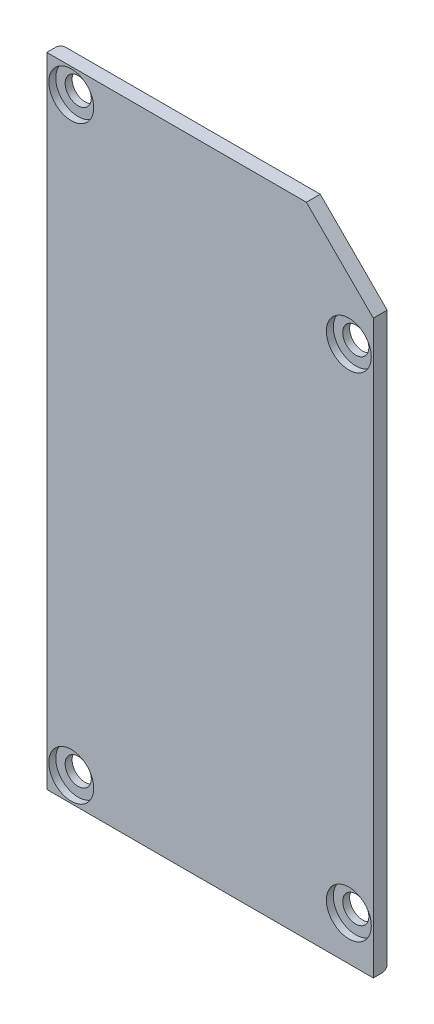
ISO-10303-21;
HEADER;
FILE_DESCRIPTION(('STEP AP214'),'2;1');
FILE_NAME('part.step','',(''),(''),'','','');
FILE_SCHEMA(('AUTOMOTIVE_DESIGN { 1 0 10303 214 1 1 1 1 }'));
ENDSEC;
DATA;
#1=APPLICATION_CONTEXT('core data for automotive mechanical design processes');
#2=APPLICATION_PROTOCOL_DEFINITION('international standard','automotive_design',2000,#1);
#3=PRODUCT_CONTEXT('',#1,'mechanical');
#4=PRODUCT('Part','Part','',(#3));
#5=PRODUCT_RELATED_PRODUCT_CATEGORY('part','',(#4));
#6=PRODUCT_DEFINITION_FORMATION('','',#4);
#7=PRODUCT_DEFINITION_CONTEXT('part definition',#1,'design');
#8=PRODUCT_DEFINITION('design','',#6,#7);
#9=PRODUCT_DEFINITION_SHAPE('','',#8);
#10=(LENGTH_UNIT() NAMED_UNIT(*) SI_UNIT(.MILLI.,.METRE.));
#11=(NAMED_UNIT(*) PLANE_ANGLE_UNIT() SI_UNIT($,.RADIAN.));
#12=(NAMED_UNIT(*) SI_UNIT($,.STERADIAN.) SOLID_ANGLE_UNIT());
#13=UNCERTAINTY_MEASURE_WITH_UNIT(LENGTH_MEASURE(1.E-05),#10,'distance_accuracy_value','');
#14=(GEOMETRIC_REPRESENTATION_CONTEXT(3) GLOBAL_UNCERTAINTY_ASSIGNED_CONTEXT((#13)) GLOBAL_UNIT_ASSIGNED_CONTEXT((#10,
#11,#12)) REPRESENTATION_CONTEXT('',''));
#15=CARTESIAN_POINT('',(0.,0.,0.));
#16=DIRECTION('',(0.,0.,1.));
#17=DIRECTION('',(1.,0.,0.));
#18=AXIS2_PLACEMENT_3D('',#15,#16,#17);
#19=CARTESIAN_POINT('',(37.,5.39999999999994,29.7));
#20=DIRECTION('',(0.,0.,-1.));
#21=DIRECTION('',(-1.,0.,0.));
#22=AXIS2_PLACEMENT_3D('',#19,#20,#21);
#23=CYLINDRICAL_SURFACE('',#22,1.6);
#24=CARTESIAN_POINT('',(37.,5.39999999999994,28.));
#25=DIRECTION('',(0.,0.,-1.));
#26=DIRECTION('',(-1.,0.,0.));
#27=AXIS2_PLACEMENT_3D('',#24,#25,#26);
#28=CIRCLE('',#27,1.6);
#29=CARTESIAN_POINT('',(35.4,5.39999999999994,28.));
#30=VERTEX_POINT('',#29);
#31=EDGE_CURVE('E237',#30,#30,#28,.T.);
#32=ORIENTED_EDGE('',*,*,#31,.T.);
#33=EDGE_LOOP('',(#32));
#34=FACE_BOUND('',#33,.T.);
#35=CARTESIAN_POINT('',(37.,5.39999999999994,28.85));
#36=DIRECTION('',(0.,0.,1.));
#37=DIRECTION('',(1.,0.,0.));
#38=AXIS2_PLACEMENT_3D('',#35,#36,#37);
#39=CIRCLE('',#38,1.6);
#40=CARTESIAN_POINT('',(38.6,5.39999999999994,28.85));
#41=VERTEX_POINT('',#40);
#42=EDGE_CURVE('E142',#41,#41,#39,.T.);
#43=ORIENTED_EDGE('',*,*,#42,.T.);
#44=EDGE_LOOP('',(#43));
#45=FACE_BOUND('',#44,.T.);
#46=ADVANCED_FACE('F37',(#34,#45),#23,.F.);
#47=CARTESIAN_POINT('',(3.,3.,29.7));
#48=DIRECTION('',(0.,0.,-1.));
#49=DIRECTION('',(-1.,0.,0.));
#50=AXIS2_PLACEMENT_3D('',#47,#48,#49);
#51=CYLINDRICAL_SURFACE('',#50,1.6);
#52=CARTESIAN_POINT('',(3.,3.,28.));
#53=DIRECTION('',(0.,0.,-1.));
#54=DIRECTION('',(-1.,0.,0.));
#55=AXIS2_PLACEMENT_3D('',#52,#53,#54);
#56=CIRCLE('',#55,1.6);
#57=CARTESIAN_POINT('',(1.4,3.,28.));
#58=VERTEX_POINT('',#57);
#59=EDGE_CURVE('E130',#58,#58,#56,.T.);
#60=ORIENTED_EDGE('',*,*,#59,.T.);
#61=EDGE_LOOP('',(#60));
#62=FACE_BOUND('',#61,.T.);
#63=CARTESIAN_POINT('',(3.,3.,28.85));
#64=DIRECTION('',(0.,0.,1.));
#65=DIRECTION('',(1.,0.,0.));
#66=AXIS2_PLACEMENT_3D('',#63,#64,#65);
#67=CIRCLE('',#66,1.6);
#68=CARTESIAN_POINT('',(4.6,3.,28.85));
#69=VERTEX_POINT('',#68);
#70=EDGE_CURVE('E137',#69,#69,#67,.T.);
#71=ORIENTED_EDGE('',*,*,#70,.T.);
#72=EDGE_LOOP('',(#71));
#73=FACE_BOUND('',#72,.T.);
#74=ADVANCED_FACE('F177',(#62,#73),#51,.F.);
#75=CARTESIAN_POINT('',(37.,65.7573593128807,29.7));
#76=DIRECTION('',(0.,0.,-1.));
#77=DIRECTION('',(-1.,0.,0.));
#78=AXIS2_PLACEMENT_3D('',#75,#76,#77);
#79=CYLINDRICAL_SURFACE('',#78,1.6);
#80=CARTESIAN_POINT('',(37.,65.7573593128807,28.));
#81=DIRECTION('',(0.,0.,-1.));
#82=DIRECTION('',(-1.,0.,0.));
#83=AXIS2_PLACEMENT_3D('',#80,#81,#82);
#84=CIRCLE('',#83,1.6);
#85=CARTESIAN_POINT('',(35.4,65.7573593128807,28.));
#86=VERTEX_POINT('',#85);
#87=EDGE_CURVE('E234',#86,#86,#84,.T.);
#88=ORIENTED_EDGE('',*,*,#87,.T.);
#89=EDGE_LOOP('',(#88));
#90=FACE_BOUND('',#89,.T.);
#91=CARTESIAN_POINT('',(37.,65.7573593128807,28.85));
#92=DIRECTION('',(0.,0.,1.));
#93=DIRECTION('',(1.,0.,0.));
#94=AXIS2_PLACEMENT_3D('',#91,#92,#93);
#95=CIRCLE('',#94,1.6);
#96=CARTESIAN_POINT('',(38.6,65.7573593128807,28.85));
#97=VERTEX_POINT('',#96);
#98=EDGE_CURVE('E132',#97,#97,#95,.T.);
#99=ORIENTED_EDGE('',*,*,#98,.T.);
#100=EDGE_LOOP('',(#99));
#101=FACE_BOUND('',#100,.T.);
#102=ADVANCED_FACE('F183',(#90,#101),#79,.F.);
#103=CARTESIAN_POINT('',(3.,75.2,29.7));
#104=DIRECTION('',(0.,0.,-1.));
#105=DIRECTION('',(-1.,0.,0.));
#106=AXIS2_PLACEMENT_3D('',#103,#104,#105);
#107=CYLINDRICAL_SURFACE('',#106,1.6);
#108=CARTESIAN_POINT('',(3.,75.2,28.));
#109=DIRECTION('',(0.,0.,-1.));
#110=DIRECTION('',(-1.,0.,0.));
#111=AXIS2_PLACEMENT_3D('',#108,#109,#110);
#112=CIRCLE('',#111,1.6);
#113=CARTESIAN_POINT('',(1.4,75.2,28.));
#114=VERTEX_POINT('',#113);
#115=EDGE_CURVE('E101',#114,#114,#112,.T.);
#116=ORIENTED_EDGE('',*,*,#115,.T.);
#117=EDGE_LOOP('',(#116));
#118=FACE_BOUND('',#117,.T.);
#119=CARTESIAN_POINT('',(3.,75.2,28.85));
#120=DIRECTION('',(0.,0.,1.));
#121=DIRECTION('',(1.,0.,0.));
#122=AXIS2_PLACEMENT_3D('',#119,#120,#121);
#123=CIRCLE('',#122,1.6);
#124=CARTESIAN_POINT('',(4.6,75.2,28.85));
#125=VERTEX_POINT('',#124);
#126=EDGE_CURVE('E127',#125,#125,#123,.T.);
#127=ORIENTED_EDGE('',*,*,#126,.T.);
#128=EDGE_LOOP('',(#127));
#129=FACE_BOUND('',#128,.T.);
#130=ADVANCED_FACE('F192',(#118,#129),#107,.F.);
#131=CARTESIAN_POINT('',(0.,0.,28.));
#132=DIRECTION('',(0.,1.,0.));
#133=DIRECTION('',(0.,0.,1.));
#134=AXIS2_PLACEMENT_3D('',#131,#132,#133);
#135=PLANE('',#134);
#136=DIRECTION('',(0.,0.,-1.));
#137=VECTOR('',#136,1.);
#138=CARTESIAN_POINT('',(0.,0.,28.));
#139=LINE('',#138,#137);
#140=CARTESIAN_POINT('',(0.,0.,29.7));
#141=VERTEX_POINT('',#140);
#142=CARTESIAN_POINT('',(0.,0.,28.6));
#143=VERTEX_POINT('',#142);
#144=EDGE_CURVE('E125',#141,#143,#139,.T.);
#145=ORIENTED_EDGE('',*,*,#144,.T.);
#146=DIRECTION('',(-1.,0.,0.));
#147=VECTOR('',#146,1.);
#148=CARTESIAN_POINT('',(40.,0.,28.6));
#149=LINE('',#148,#147);
#150=CARTESIAN_POINT('',(40.,0.,28.6));
#151=VERTEX_POINT('',#150);
#152=EDGE_CURVE('E150',#143,#151,#149,.F.);
#153=ORIENTED_EDGE('',*,*,#152,.T.);
#154=DIRECTION('',(0.,0.,-1.));
#155=VECTOR('',#154,1.);
#156=CARTESIAN_POINT('',(40.,0.,28.));
#157=LINE('',#156,#155);
#158=CARTESIAN_POINT('',(40.,0.,29.7));
#159=VERTEX_POINT('',#158);
#160=EDGE_CURVE('E118',#159,#151,#157,.T.);
#161=ORIENTED_EDGE('',*,*,#160,.F.);
#162=DIRECTION('',(1.,0.,0.));
#163=VECTOR('',#162,1.);
#164=CARTESIAN_POINT('',(40.,0.,29.7));
#165=LINE('',#164,#163);
#166=EDGE_CURVE('E220',#141,#159,#165,.T.);
#167=ORIENTED_EDGE('',*,*,#166,.F.);
#168=EDGE_LOOP('',(#145,#153,#161,#167));
#169=FACE_BOUND('',#168,.T.);
#170=ADVANCED_FACE('F196',(#169),#135,.F.);
#171=CARTESIAN_POINT('',(40.,0.,28.));
#172=DIRECTION('',(-1.,0.,0.));
#173=DIRECTION('',(0.,0.,1.));
#174=AXIS2_PLACEMENT_3D('',#171,#172,#173);
#175=PLANE('',#174);
#176=ORIENTED_EDGE('',*,*,#160,.T.);
#177=CARTESIAN_POINT('',(40.,0.6,28.6));
#178=DIRECTION('',(-1.,0.,0.));
#179=DIRECTION('',(0.,0.,1.));
#180=AXIS2_PLACEMENT_3D('',#177,#178,#179);
#181=CIRCLE('',#180,0.6);
#182=CARTESIAN_POINT('',(40.,0.6,28.));
#183=VERTEX_POINT('',#182);
#184=EDGE_CURVE('E152',#151,#183,#181,.F.);
#185=ORIENTED_EDGE('',*,*,#184,.T.);
#186=DIRECTION('',(0.,-1.,0.));
#187=VECTOR('',#186,1.);
#188=CARTESIAN_POINT('',(40.,0.,28.));
#189=LINE('',#188,#187);
#190=CARTESIAN_POINT('',(40.,70.,28.));
#191=VERTEX_POINT('',#190);
#192=EDGE_CURVE('E110',#191,#183,#189,.T.);
#193=ORIENTED_EDGE('',*,*,#192,.F.);
#194=DIRECTION('',(0.,0.,-1.));
#195=VECTOR('',#194,1.);
#196=CARTESIAN_POINT('',(40.,70.,28.));
#197=LINE('',#196,#195);
#198=CARTESIAN_POINT('',(40.,70.,29.7));
#199=VERTEX_POINT('',#198);
#200=EDGE_CURVE('E109',#199,#191,#197,.T.);
#201=ORIENTED_EDGE('',*,*,#200,.F.);
#202=DIRECTION('',(0.,1.,0.));
#203=VECTOR('',#202,1.);
#204=CARTESIAN_POINT('',(40.,70.,29.7));
#205=LINE('',#204,#203);
#206=EDGE_CURVE('E225',#159,#199,#205,.T.);
#207=ORIENTED_EDGE('',*,*,#206,.F.);
#208=EDGE_LOOP('',(#176,#185,#193,#201,#207));
#209=FACE_BOUND('',#208,.T.);
#210=ADVANCED_FACE('F156',(#209),#175,.F.);
#211=CARTESIAN_POINT('',(31.8000000000001,78.2,28.));
#212=DIRECTION('',(-0.707106781186551,-0.707106781186544,0.));
#213=DIRECTION('',(0.707106781186544,-0.707106781186551,0.));
#214=AXIS2_PLACEMENT_3D('',#211,#212,#213);
#215=PLANE('',#214);
#216=DIRECTION('',(0.707106781186544,-0.707106781186551,0.));
#217=VECTOR('',#216,1.);
#218=CARTESIAN_POINT('',(31.8000000000001,78.2,28.));
#219=LINE('',#218,#217);
#220=CARTESIAN_POINT('',(31.8000000000001,78.2,28.));
#221=VERTEX_POINT('',#220);
#222=EDGE_CURVE('E95',#221,#191,#219,.T.);
#223=ORIENTED_EDGE('',*,*,#222,.F.);
#224=DIRECTION('',(0.,0.,-1.));
#225=VECTOR('',#224,1.);
#226=CARTESIAN_POINT('',(31.8000000000001,78.2,28.));
#227=LINE('',#226,#225);
#228=CARTESIAN_POINT('',(31.8000000000001,78.2,29.7));
#229=VERTEX_POINT('',#228);
#230=EDGE_CURVE('E107',#229,#221,#227,.T.);
#231=ORIENTED_EDGE('',*,*,#230,.F.);
#232=DIRECTION('',(-0.707106781186544,0.707106781186551,0.));
#233=VECTOR('',#232,1.);
#234=CARTESIAN_POINT('',(31.8000000000001,78.2,29.7));
#235=LINE('',#234,#233);
#236=EDGE_CURVE('E230',#199,#229,#235,.T.);
#237=ORIENTED_EDGE('',*,*,#236,.F.);
#238=ORIENTED_EDGE('',*,*,#200,.T.);
#239=EDGE_LOOP('',(#223,#231,#237,#238));
#240=FACE_BOUND('',#239,.T.);
#241=ADVANCED_FACE('F105',(#240),#215,.F.);
#242=CARTESIAN_POINT('',(0.,78.2,28.));
#243=DIRECTION('',(0.,-1.,0.));
#244=DIRECTION('',(0.,0.,-1.));
#245=AXIS2_PLACEMENT_3D('',#242,#243,#244);
#246=PLANE('',#245);
#247=DIRECTION('',(1.,0.,0.));
#248=VECTOR('',#247,1.);
#249=CARTESIAN_POINT('',(0.,78.2,28.));
#250=LINE('',#249,#248);
#251=CARTESIAN_POINT('',(0.6,78.2,28.));
#252=VERTEX_POINT('',#251);
#253=EDGE_CURVE('E90',#252,#221,#250,.T.);
#254=ORIENTED_EDGE('',*,*,#253,.F.);
#255=CARTESIAN_POINT('',(0.6,78.2,28.6));
#256=DIRECTION('',(0.,-1.,0.));
#257=DIRECTION('',(0.,0.,-1.));
#258=AXIS2_PLACEMENT_3D('',#255,#256,#257);
#259=CIRCLE('',#258,0.6);
#260=CARTESIAN_POINT('',(0.,78.2,28.6));
#261=VERTEX_POINT('',#260);
#262=EDGE_CURVE('E11',#252,#261,#259,.F.);
#263=ORIENTED_EDGE('',*,*,#262,.T.);
#264=DIRECTION('',(0.,0.,-1.));
#265=VECTOR('',#264,1.);
#266=CARTESIAN_POINT('',(0.,78.2,28.));
#267=LINE('',#266,#265);
#268=CARTESIAN_POINT('',(0.,78.2,29.7));
#269=VERTEX_POINT('',#268);
#270=EDGE_CURVE('E116',#269,#261,#267,.T.);
#271=ORIENTED_EDGE('',*,*,#270,.F.);
#272=DIRECTION('',(-1.,0.,0.));
#273=VECTOR('',#272,1.);
#274=CARTESIAN_POINT('',(0.,78.2,29.7));
#275=LINE('',#274,#273);
#276=EDGE_CURVE('E115',#229,#269,#275,.T.);
#277=ORIENTED_EDGE('',*,*,#276,.F.);
#278=ORIENTED_EDGE('',*,*,#230,.T.);
#279=EDGE_LOOP('',(#254,#263,#271,#277,#278));
#280=FACE_BOUND('',#279,.T.);
#281=ADVANCED_FACE('F113',(#280),#246,.F.);
#282=CARTESIAN_POINT('',(0.,78.2,28.));
#283=DIRECTION('',(1.,0.,0.));
#284=DIRECTION('',(0.,0.,-1.));
#285=AXIS2_PLACEMENT_3D('',#282,#283,#284);
#286=PLANE('',#285);
#287=ORIENTED_EDGE('',*,*,#270,.T.);
#288=DIRECTION('',(0.,-1.,0.));
#289=VECTOR('',#288,1.);
#290=CARTESIAN_POINT('',(0.,0.,28.6));
#291=LINE('',#290,#289);
#292=EDGE_CURVE('E46',#261,#143,#291,.T.);
#293=ORIENTED_EDGE('',*,*,#292,.T.);
#294=ORIENTED_EDGE('',*,*,#144,.F.);
#295=DIRECTION('',(0.,-1.,0.));
#296=VECTOR('',#295,1.);
#297=CARTESIAN_POINT('',(0.,0.,29.7));
#298=LINE('',#297,#296);
#299=EDGE_CURVE('E161',#269,#141,#298,.T.);
#300=ORIENTED_EDGE('',*,*,#299,.F.);
#301=EDGE_LOOP('',(#287,#293,#294,#300));
#302=FACE_BOUND('',#301,.T.);
#303=ADVANCED_FACE('F201',(#302),#286,.F.);
#304=CARTESIAN_POINT('',(0.,0.,29.7));
#305=DIRECTION('',(0.,0.,-1.));
#306=DIRECTION('',(-1.,0.,0.));
#307=AXIS2_PLACEMENT_3D('',#304,#305,#306);
#308=PLANE('',#307);
#309=CARTESIAN_POINT('',(37.,5.39999999999994,29.7));
#310=DIRECTION('',(0.,0.,1.));
#311=DIRECTION('',(1.,0.,0.));
#312=AXIS2_PLACEMENT_3D('',#309,#310,#311);
#313=CIRCLE('',#312,2.75);
#314=CARTESIAN_POINT('',(39.75,5.39999999999994,29.7));
#315=VERTEX_POINT('',#314);
#316=EDGE_CURVE('E166',#315,#315,#313,.T.);
#317=ORIENTED_EDGE('',*,*,#316,.F.);
#318=EDGE_LOOP('',(#317));
#319=FACE_BOUND('',#318,.T.);
#320=CARTESIAN_POINT('',(3.,3.,29.7));
#321=DIRECTION('',(0.,0.,1.));
#322=DIRECTION('',(1.,0.,0.));
#323=AXIS2_PLACEMENT_3D('',#320,#321,#322);
#324=CIRCLE('',#323,2.75);
#325=CARTESIAN_POINT('',(5.75,3.,29.7));
#326=VERTEX_POINT('',#325);
#327=EDGE_CURVE('E145',#326,#326,#324,.T.);
#328=ORIENTED_EDGE('',*,*,#327,.F.);
#329=EDGE_LOOP('',(#328));
#330=FACE_BOUND('',#329,.T.);
#331=CARTESIAN_POINT('',(37.,65.7573593128807,29.7));
#332=DIRECTION('',(0.,0.,1.));
#333=DIRECTION('',(1.,0.,0.));
#334=AXIS2_PLACEMENT_3D('',#331,#332,#333);
#335=CIRCLE('',#334,2.75);
#336=CARTESIAN_POINT('',(39.75,65.7573593128807,29.7));
#337=VERTEX_POINT('',#336);
#338=EDGE_CURVE('E140',#337,#337,#335,.T.);
#339=ORIENTED_EDGE('',*,*,#338,.F.);
#340=EDGE_LOOP('',(#339));
#341=FACE_BOUND('',#340,.T.);
#342=CARTESIAN_POINT('',(3.,75.2,29.7));
#343=DIRECTION('',(0.,0.,1.));
#344=DIRECTION('',(1.,0.,0.));
#345=AXIS2_PLACEMENT_3D('',#342,#343,#344);
#346=CIRCLE('',#345,2.75);
#347=CARTESIAN_POINT('',(5.75,75.2,29.7));
#348=VERTEX_POINT('',#347);
#349=EDGE_CURVE('E135',#348,#348,#346,.T.);
#350=ORIENTED_EDGE('',*,*,#349,.F.);
#351=EDGE_LOOP('',(#350));
#352=FACE_BOUND('',#351,.T.);
#353=ORIENTED_EDGE('',*,*,#299,.T.);
#354=ORIENTED_EDGE('',*,*,#166,.T.);
#355=ORIENTED_EDGE('',*,*,#206,.T.);
#356=ORIENTED_EDGE('',*,*,#236,.T.);
#357=ORIENTED_EDGE('',*,*,#276,.T.);
#358=EDGE_LOOP('',(#353,#354,#355,#356,#357));
#359=FACE_BOUND('',#358,.T.);
#360=ADVANCED_FACE('F198',(#319,#330,#341,#352,#359),#308,.F.);
#361=CARTESIAN_POINT('',(0.,0.,28.));
#362=DIRECTION('',(0.,0.,-1.));
#363=DIRECTION('',(-1.,0.,0.));
#364=AXIS2_PLACEMENT_3D('',#361,#362,#363);
#365=PLANE('',#364);
#366=ORIENTED_EDGE('',*,*,#192,.T.);
#367=DIRECTION('',(-1.,0.,0.));
#368=VECTOR('',#367,1.);
#369=CARTESIAN_POINT('',(0.,0.6,28.));
#370=LINE('',#369,#368);
#371=CARTESIAN_POINT('',(0.6,0.6,28.));
#372=VERTEX_POINT('',#371);
#373=EDGE_CURVE('E148',#183,#372,#370,.T.);
#374=ORIENTED_EDGE('',*,*,#373,.T.);
#375=DIRECTION('',(0.,-1.,0.));
#376=VECTOR('',#375,1.);
#377=CARTESIAN_POINT('',(0.6,78.2,28.));
#378=LINE('',#377,#376);
#379=EDGE_CURVE('E99',#372,#252,#378,.F.);
#380=ORIENTED_EDGE('',*,*,#379,.T.);
#381=ORIENTED_EDGE('',*,*,#253,.T.);
#382=ORIENTED_EDGE('',*,*,#222,.T.);
#383=EDGE_LOOP('',(#366,#374,#380,#381,#382));
#384=FACE_BOUND('',#383,.T.);
#385=ORIENTED_EDGE('',*,*,#59,.F.);
#386=EDGE_LOOP('',(#385));
#387=FACE_BOUND('',#386,.T.);
#388=ORIENTED_EDGE('',*,*,#31,.F.);
#389=EDGE_LOOP('',(#388));
#390=FACE_BOUND('',#389,.T.);
#391=ORIENTED_EDGE('',*,*,#87,.F.);
#392=EDGE_LOOP('',(#391));
#393=FACE_BOUND('',#392,.T.);
#394=ORIENTED_EDGE('',*,*,#115,.F.);
#395=EDGE_LOOP('',(#394));
#396=FACE_BOUND('',#395,.T.);
#397=ADVANCED_FACE('F93',(#384,#387,#390,#393,#396),#365,.T.);
#398=CARTESIAN_POINT('',(3.,75.2,28.85));
#399=DIRECTION('',(0.,0.,1.));
#400=DIRECTION('',(1.,0.,0.));
#401=AXIS2_PLACEMENT_3D('',#398,#399,#400);
#402=CYLINDRICAL_SURFACE('',#401,2.75);
#403=CARTESIAN_POINT('',(3.,75.2,28.85));
#404=DIRECTION('',(0.,0.,1.));
#405=DIRECTION('',(1.,0.,0.));
#406=AXIS2_PLACEMENT_3D('',#403,#404,#405);
#407=CIRCLE('',#406,2.75);
#408=CARTESIAN_POINT('',(5.75,75.2,28.85));
#409=VERTEX_POINT('',#408);
#410=EDGE_CURVE('E131',#409,#409,#407,.T.);
#411=ORIENTED_EDGE('',*,*,#410,.F.);
#412=EDGE_LOOP('',(#411));
#413=FACE_BOUND('',#412,.T.);
#414=ORIENTED_EDGE('',*,*,#349,.T.);
#415=EDGE_LOOP('',(#414));
#416=FACE_BOUND('',#415,.T.);
#417=ADVANCED_FACE('F205',(#413,#416),#402,.F.);
#418=CARTESIAN_POINT('',(3.,75.2,28.85));
#419=DIRECTION('',(0.,0.,1.));
#420=DIRECTION('',(1.,0.,0.));
#421=AXIS2_PLACEMENT_3D('',#418,#419,#420);
#422=PLANE('',#421);
#423=ORIENTED_EDGE('',*,*,#126,.F.);
#424=EDGE_LOOP('',(#423));
#425=FACE_BOUND('',#424,.T.);
#426=ORIENTED_EDGE('',*,*,#410,.T.);
#427=EDGE_LOOP('',(#426));
#428=FACE_BOUND('',#427,.T.);
#429=ADVANCED_FACE('F272',(#425,#428),#422,.T.);
#430=CARTESIAN_POINT('',(37.,65.7573593128807,28.85));
#431=DIRECTION('',(0.,0.,1.));
#432=DIRECTION('',(1.,0.,0.));
#433=AXIS2_PLACEMENT_3D('',#430,#431,#432);
#434=CYLINDRICAL_SURFACE('',#433,2.75);
#435=CARTESIAN_POINT('',(37.,65.7573593128807,28.85));
#436=DIRECTION('',(0.,0.,1.));
#437=DIRECTION('',(1.,0.,0.));
#438=AXIS2_PLACEMENT_3D('',#435,#436,#437);
#439=CIRCLE('',#438,2.75);
#440=CARTESIAN_POINT('',(39.75,65.7573593128807,28.85));
#441=VERTEX_POINT('',#440);
#442=EDGE_CURVE('E136',#441,#441,#439,.T.);
#443=ORIENTED_EDGE('',*,*,#442,.F.);
#444=EDGE_LOOP('',(#443));
#445=FACE_BOUND('',#444,.T.);
#446=ORIENTED_EDGE('',*,*,#338,.T.);
#447=EDGE_LOOP('',(#446));
#448=FACE_BOUND('',#447,.T.);
#449=ADVANCED_FACE('F277',(#445,#448),#434,.F.);
#450=CARTESIAN_POINT('',(37.,65.7573593128807,28.85));
#451=DIRECTION('',(0.,0.,1.));
#452=DIRECTION('',(1.,0.,0.));
#453=AXIS2_PLACEMENT_3D('',#450,#451,#452);
#454=PLANE('',#453);
#455=ORIENTED_EDGE('',*,*,#98,.F.);
#456=EDGE_LOOP('',(#455));
#457=FACE_BOUND('',#456,.T.);
#458=ORIENTED_EDGE('',*,*,#442,.T.);
#459=EDGE_LOOP('',(#458));
#460=FACE_BOUND('',#459,.T.);
#461=ADVANCED_FACE('F284',(#457,#460),#454,.T.);
#462=CARTESIAN_POINT('',(3.,3.,28.85));
#463=DIRECTION('',(0.,0.,1.));
#464=DIRECTION('',(1.,0.,0.));
#465=AXIS2_PLACEMENT_3D('',#462,#463,#464);
#466=CYLINDRICAL_SURFACE('',#465,2.75);
#467=CARTESIAN_POINT('',(3.,3.,28.85));
#468=DIRECTION('',(0.,0.,1.));
#469=DIRECTION('',(1.,0.,0.));
#470=AXIS2_PLACEMENT_3D('',#467,#468,#469);
#471=CIRCLE('',#470,2.75);
#472=CARTESIAN_POINT('',(5.75,3.,28.85));
#473=VERTEX_POINT('',#472);
#474=EDGE_CURVE('E141',#473,#473,#471,.T.);
#475=ORIENTED_EDGE('',*,*,#474,.F.);
#476=EDGE_LOOP('',(#475));
#477=FACE_BOUND('',#476,.T.);
#478=ORIENTED_EDGE('',*,*,#327,.T.);
#479=EDGE_LOOP('',(#478));
#480=FACE_BOUND('',#479,.T.);
#481=ADVANCED_FACE('F288',(#477,#480),#466,.F.);
#482=CARTESIAN_POINT('',(3.,3.,28.85));
#483=DIRECTION('',(0.,0.,1.));
#484=DIRECTION('',(1.,0.,0.));
#485=AXIS2_PLACEMENT_3D('',#482,#483,#484);
#486=PLANE('',#485);
#487=ORIENTED_EDGE('',*,*,#70,.F.);
#488=EDGE_LOOP('',(#487));
#489=FACE_BOUND('',#488,.T.);
#490=ORIENTED_EDGE('',*,*,#474,.T.);
#491=EDGE_LOOP('',(#490));
#492=FACE_BOUND('',#491,.T.);
#493=ADVANCED_FACE('F261',(#489,#492),#486,.T.);
#494=CARTESIAN_POINT('',(37.,5.39999999999994,28.85));
#495=DIRECTION('',(0.,0.,1.));
#496=DIRECTION('',(1.,0.,0.));
#497=AXIS2_PLACEMENT_3D('',#494,#495,#496);
#498=CYLINDRICAL_SURFACE('',#497,2.75);
#499=CARTESIAN_POINT('',(37.,5.39999999999994,28.85));
#500=DIRECTION('',(0.,0.,1.));
#501=DIRECTION('',(1.,0.,0.));
#502=AXIS2_PLACEMENT_3D('',#499,#500,#501);
#503=CIRCLE('',#502,2.75);
#504=CARTESIAN_POINT('',(39.75,5.39999999999994,28.85));
#505=VERTEX_POINT('',#504);
#506=EDGE_CURVE('E146',#505,#505,#503,.T.);
#507=ORIENTED_EDGE('',*,*,#506,.F.);
#508=EDGE_LOOP('',(#507));
#509=FACE_BOUND('',#508,.T.);
#510=ORIENTED_EDGE('',*,*,#316,.T.);
#511=EDGE_LOOP('',(#510));
#512=FACE_BOUND('',#511,.T.);
#513=ADVANCED_FACE('F173',(#509,#512),#498,.F.);
#514=CARTESIAN_POINT('',(37.,5.39999999999994,28.85));
#515=DIRECTION('',(0.,0.,1.));
#516=DIRECTION('',(1.,0.,0.));
#517=AXIS2_PLACEMENT_3D('',#514,#515,#516);
#518=PLANE('',#517);
#519=ORIENTED_EDGE('',*,*,#42,.F.);
#520=EDGE_LOOP('',(#519));
#521=FACE_BOUND('',#520,.T.);
#522=ORIENTED_EDGE('',*,*,#506,.T.);
#523=EDGE_LOOP('',(#522));
#524=FACE_BOUND('',#523,.T.);
#525=ADVANCED_FACE('F168',(#521,#524),#518,.T.);
#526=CARTESIAN_POINT('',(0.6,78.2,28.6));
#527=DIRECTION('',(0.,1.,0.));
#528=DIRECTION('',(0.,0.,1.));
#529=AXIS2_PLACEMENT_3D('',#526,#527,#528);
#530=CYLINDRICAL_SURFACE('',#529,0.6);
#531=ORIENTED_EDGE('',*,*,#262,.F.);
#532=ORIENTED_EDGE('',*,*,#379,.F.);
#533=CARTESIAN_POINT('',(0.6,0.600000000000002,28.6));
#534=DIRECTION('',(-0.707106781186547,0.707106781186547,0.));
#535=DIRECTION('',(0.707106781186547,0.707106781186547,0.));
#536=AXIS2_PLACEMENT_3D('',#533,#534,#535);
#537=ELLIPSE('',#536,0.848528137423857,0.6);
#538=EDGE_CURVE('E41',#143,#372,#537,.F.);
#539=ORIENTED_EDGE('',*,*,#538,.F.);
#540=ORIENTED_EDGE('',*,*,#292,.F.);
#541=EDGE_LOOP('',(#531,#532,#539,#540));
#542=FACE_BOUND('',#541,.T.);
#543=ADVANCED_FACE('F39',(#542),#530,.T.);
#544=CARTESIAN_POINT('',(0.,0.6,28.6));
#545=DIRECTION('',(1.,0.,0.));
#546=DIRECTION('',(0.,0.,-1.));
#547=AXIS2_PLACEMENT_3D('',#544,#545,#546);
#548=CYLINDRICAL_SURFACE('',#547,0.6);
#549=ORIENTED_EDGE('',*,*,#184,.F.);
#550=ORIENTED_EDGE('',*,*,#152,.F.);
#551=ORIENTED_EDGE('',*,*,#538,.T.);
#552=ORIENTED_EDGE('',*,*,#373,.F.);
#553=EDGE_LOOP('',(#549,#550,#551,#552));
#554=FACE_BOUND('',#553,.T.);
#555=ADVANCED_FACE('F163',(#554),#548,.T.);
#556=CLOSED_SHELL('',(#46,#74,#102,#130,#170,#210,#241,#281,#303,#360,#397,#417,#429,#449,#461,
#481,#493,#513,#525,#543,#555));
#557=MANIFOLD_SOLID_BREP('B2',#556);
#558=ADVANCED_BREP_SHAPE_REPRESENTATION('',(#18,#557),#14);
#559=SHAPE_DEFINITION_REPRESENTATION(#9,#558);
ENDSEC;
END-ISO-10303-21;
